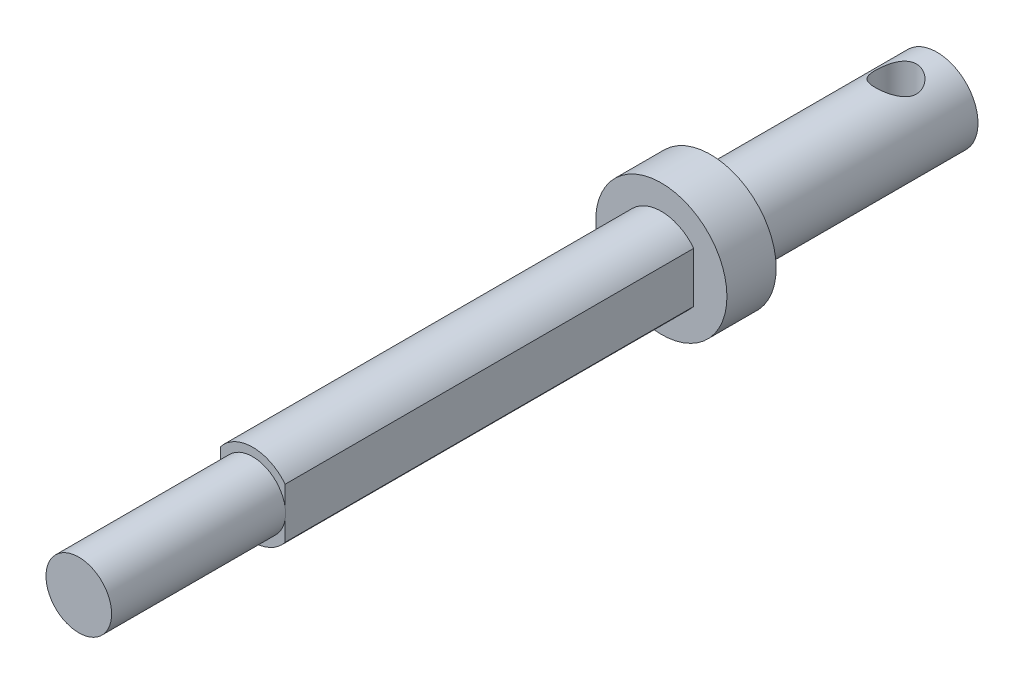
ISO-10303-21;
HEADER;
FILE_DESCRIPTION(('STEP AP214'),'2;1');
FILE_NAME('part.step','',(''),(''),'','','');
FILE_SCHEMA(('AUTOMOTIVE_DESIGN { 1 0 10303 214 1 1 1 1 }'));
ENDSEC;
DATA;
#1=APPLICATION_CONTEXT('core data for automotive mechanical design processes');
#2=APPLICATION_PROTOCOL_DEFINITION('international standard','automotive_design',2000,#1);
#3=PRODUCT_CONTEXT('',#1,'mechanical');
#4=PRODUCT('Part','Part','',(#3));
#5=PRODUCT_RELATED_PRODUCT_CATEGORY('part','',(#4));
#6=PRODUCT_DEFINITION_FORMATION('','',#4);
#7=PRODUCT_DEFINITION_CONTEXT('part definition',#1,'design');
#8=PRODUCT_DEFINITION('design','',#6,#7);
#9=PRODUCT_DEFINITION_SHAPE('','',#8);
#10=(LENGTH_UNIT() NAMED_UNIT(*) SI_UNIT(.MILLI.,.METRE.));
#11=(NAMED_UNIT(*) PLANE_ANGLE_UNIT() SI_UNIT($,.RADIAN.));
#12=(NAMED_UNIT(*) SI_UNIT($,.STERADIAN.) SOLID_ANGLE_UNIT());
#13=UNCERTAINTY_MEASURE_WITH_UNIT(LENGTH_MEASURE(1.E-05),#10,'distance_accuracy_value','');
#14=(GEOMETRIC_REPRESENTATION_CONTEXT(3) GLOBAL_UNCERTAINTY_ASSIGNED_CONTEXT((#13)) GLOBAL_UNIT_ASSIGNED_CONTEXT((#10,
#11,#12)) REPRESENTATION_CONTEXT('',''));
#15=CARTESIAN_POINT('',(0.,0.,0.));
#16=DIRECTION('',(0.,0.,1.));
#17=DIRECTION('',(1.,0.,0.));
#18=AXIS2_PLACEMENT_3D('',#15,#16,#17);
#19=CARTESIAN_POINT('',(0.,0.,41.7));
#20=DIRECTION('',(0.,0.,1.));
#21=DIRECTION('',(1.,0.,0.));
#22=AXIS2_PLACEMENT_3D('',#19,#20,#21);
#23=PLANE('',#22);
#24=CARTESIAN_POINT('',(0.,0.,41.7));
#25=DIRECTION('',(0.,0.,1.));
#26=DIRECTION('',(1.,0.,0.));
#27=AXIS2_PLACEMENT_3D('',#24,#25,#26);
#28=CIRCLE('',#27,2.);
#29=CARTESIAN_POINT('',(1.975,0.315238005322961,41.7));
#30=VERTEX_POINT('',#29);
#31=CARTESIAN_POINT('',(-1.975,0.315238005322961,41.7));
#32=VERTEX_POINT('',#31);
#33=EDGE_CURVE('E62',#30,#32,#28,.T.);
#34=ORIENTED_EDGE('',*,*,#33,.F.);
#35=DIRECTION('',(0.,-1.,0.));
#36=VECTOR('',#35,1.);
#37=CARTESIAN_POINT('',(1.975,0.,41.7));
#38=LINE('',#37,#36);
#39=CARTESIAN_POINT('',(1.975,1.53276710559693,41.7));
#40=VERTEX_POINT('',#39);
#41=EDGE_CURVE('E115',#40,#30,#38,.T.);
#42=ORIENTED_EDGE('',*,*,#41,.F.);
#43=CARTESIAN_POINT('',(0.,0.,41.7));
#44=DIRECTION('',(0.,0.,1.));
#45=DIRECTION('',(1.,0.,0.));
#46=AXIS2_PLACEMENT_3D('',#43,#44,#45);
#47=CIRCLE('',#46,2.5);
#48=CARTESIAN_POINT('',(-1.975,1.53276710559693,41.7));
#49=VERTEX_POINT('',#48);
#50=EDGE_CURVE('E145',#40,#49,#47,.T.);
#51=ORIENTED_EDGE('',*,*,#50,.T.);
#52=DIRECTION('',(0.,-1.,0.));
#53=VECTOR('',#52,1.);
#54=CARTESIAN_POINT('',(-1.975,0.,41.7));
#55=LINE('',#54,#53);
#56=EDGE_CURVE('E149',#49,#32,#55,.T.);
#57=ORIENTED_EDGE('',*,*,#56,.T.);
#58=EDGE_LOOP('',(#34,#42,#51,#57));
#59=FACE_BOUND('',#58,.T.);
#60=ADVANCED_FACE('F45',(#59),#23,.T.);
#61=CARTESIAN_POINT('',(0.,0.,13.8));
#62=DIRECTION('',(0.,0.,-1.));
#63=DIRECTION('',(-1.,0.,0.));
#64=AXIS2_PLACEMENT_3D('',#61,#62,#63);
#65=CYLINDRICAL_SURFACE('',#64,2.5);
#66=CARTESIAN_POINT('',(0.,-2.5,3.75));
#67=CARTESIAN_POINT('',(0.0657149536912331,-2.49999641755188,3.74999587210062));
#68=CARTESIAN_POINT('',(0.131508249622541,-2.49738113774397,3.74478740859791));
#69=CARTESIAN_POINT('',(0.261150294085531,-2.48717695046745,3.72418389957385));
#70=CARTESIAN_POINT('',(0.32499510839188,-2.47957859786229,3.70876950875294));
#71=CARTESIAN_POINT('',(0.448666931100718,-2.46020349254139,3.66850773922901));
#72=CARTESIAN_POINT('',(0.508508503673975,-2.448442989719,3.64369701968998));
#73=CARTESIAN_POINT('',(0.623090771008206,-2.42182220644723,3.58553672329382));
#74=CARTESIAN_POINT('',(0.677831867487563,-2.40696217041913,3.55218781968893));
#75=CARTESIAN_POINT('',(0.784384772202399,-2.37445322822571,3.47560343814338));
#76=CARTESIAN_POINT('',(0.83581901390264,-2.3566899890942,3.43189190095045));
#77=CARTESIAN_POINT('',(0.930974306083722,-2.3207496280843,3.33684815094121));
#78=CARTESIAN_POINT('',(0.974689478883458,-2.30257220261294,3.28551018528445));
#79=CARTESIAN_POINT('',(1.05656500056285,-2.26623688996684,3.17189581309577));
#80=CARTESIAN_POINT('',(1.09403166943955,-2.24818983712665,3.10907987706761));
#81=CARTESIAN_POINT('',(1.15771028361337,-2.21607473465401,2.97704083001723));
#82=CARTESIAN_POINT('',(1.18393026870792,-2.20200384508737,2.90782233909656));
#83=CARTESIAN_POINT('',(1.22266555273574,-2.18072333797261,2.7691686182226));
#84=CARTESIAN_POINT('',(1.23590732135055,-2.17315339479642,2.69999443491576));
#85=CARTESIAN_POINT('',(1.25053374163606,-2.1647736243566,2.56002645277565));
#86=CARTESIAN_POINT('',(1.25193011046634,-2.1639571167911,2.48923432391106));
#87=CARTESIAN_POINT('',(1.24335910896537,-2.16888662821561,2.35714246960579));
#88=CARTESIAN_POINT('',(1.23473069942103,-2.17385954577517,2.29571996097119));
#89=CARTESIAN_POINT('',(1.20867481132117,-2.18845285917313,2.1753476132837));
#90=CARTESIAN_POINT('',(1.19124452987206,-2.1980747353972,2.11639856836836));
#91=CARTESIAN_POINT('',(1.1477622254825,-2.22109345515926,2.00096358429293));
#92=CARTESIAN_POINT('',(1.12151883389499,-2.23457300829998,1.94456700151776));
#93=CARTESIAN_POINT('',(1.061302109585,-2.26379255351755,1.83670713426249));
#94=CARTESIAN_POINT('',(1.02732530476558,-2.27953355975238,1.78524608049989));
#95=CARTESIAN_POINT('',(0.947582568640986,-2.31391447379107,1.68184843407097));
#96=CARTESIAN_POINT('',(0.900868072961602,-2.33266887795933,1.6306789080298));
#97=CARTESIAN_POINT('',(0.799444473426717,-2.36934529125509,1.53658072676137));
#98=CARTESIAN_POINT('',(0.744731570717857,-2.38726689948501,1.49365600995765));
#99=CARTESIAN_POINT('',(0.625645632289811,-2.42127484103705,1.41539292371284));
#100=CARTESIAN_POINT('',(0.560941989499261,-2.43723730202509,1.38049940944282));
#101=CARTESIAN_POINT('',(0.425582769360996,-2.46447351401553,1.32237871369624));
#102=CARTESIAN_POINT('',(0.354931970331596,-2.47575098679441,1.29914226873104));
#103=CARTESIAN_POINT('',(0.215958114575877,-2.49155417176795,1.26690574535416));
#104=CARTESIAN_POINT('',(0.147926913185405,-2.4965617287664,1.25688595531653));
#105=CARTESIAN_POINT('',(0.0109744999366921,-2.50091266823877,1.24816908608189));
#106=CARTESIAN_POINT('',(-0.0579462748373765,-2.5002587340164,1.24946664295065));
#107=CARTESIAN_POINT('',(-0.189041214982492,-2.49363990316801,1.26275836052344));
#108=CARTESIAN_POINT('',(-0.251324260062442,-2.48809057110237,1.27391566591254));
#109=CARTESIAN_POINT('',(-0.373008615377395,-2.47277714143524,1.30529758986886));
#110=CARTESIAN_POINT('',(-0.432409607113746,-2.46301257917916,1.3255232080667));
#111=CARTESIAN_POINT('',(-0.548610760562082,-2.43980314267087,1.37499808304146));
#112=CARTESIAN_POINT('',(-0.605287996257692,-2.42626102212424,1.40448881264602));
#113=CARTESIAN_POINT('',(-0.713076702123651,-2.39679967896386,1.47138441955755));
#114=CARTESIAN_POINT('',(-0.764185787219103,-2.38087944457231,1.50879266824179));
#115=CARTESIAN_POINT('',(-0.864709611613316,-2.3463527667183,1.59470053166609));
#116=CARTESIAN_POINT('',(-0.913465097280799,-2.32763606060552,1.64392858556696));
#117=CARTESIAN_POINT('',(-1.00232040139155,-2.29077989504843,1.74990643908663));
#118=CARTESIAN_POINT('',(-1.04241423211355,-2.27264084226908,1.80666139852047));
#119=CARTESIAN_POINT('',(-1.11463489312212,-2.23813990282585,1.92955456775039));
#120=CARTESIAN_POINT('',(-1.1462818698483,-2.2219066207934,1.99601408276074));
#121=CARTESIAN_POINT('',(-1.19760353251725,-2.19467590460158,2.13438758461565));
#122=CARTESIAN_POINT('',(-1.21729364485946,-2.18367172800773,2.20629440812648));
#123=CARTESIAN_POINT('',(-1.2423271093121,-2.16951876260833,2.34613777857681));
#124=CARTESIAN_POINT('',(-1.24886624550108,-2.16571729325614,2.41379281678629));
#125=CARTESIAN_POINT('',(-1.25086144297598,-2.16456693307719,2.54930883396341));
#126=CARTESIAN_POINT('',(-1.2463223082805,-2.16721524534441,2.61716971092429));
#127=CARTESIAN_POINT('',(-1.22740765699033,-2.17797327562531,2.74435437691502));
#128=CARTESIAN_POINT('',(-1.2140103929285,-2.18553868102992,2.8038755876805));
#129=CARTESIAN_POINT('',(-1.17896919778081,-2.20463770234897,2.91976014928088));
#130=CARTESIAN_POINT('',(-1.15732261394976,-2.21617259462094,2.97612247761496));
#131=CARTESIAN_POINT('',(-1.10476968162585,-2.2428566295566,3.08828106373326));
#132=CARTESIAN_POINT('',(-1.07333892227057,-2.25819652995238,3.14378487728713));
#133=CARTESIAN_POINT('',(-1.00268871454579,-2.29044164543238,3.24909317022573));
#134=CARTESIAN_POINT('',(-0.963465214048311,-2.30734767243153,3.29889466314811));
#135=CARTESIAN_POINT('',(-0.872754158330802,-2.34327903949141,3.39767747794702));
#136=CARTESIAN_POINT('',(-0.820355528762714,-2.36231229139336,3.4458238779524));
#137=CARTESIAN_POINT('',(-0.70769350777535,-2.3984719031886,3.53282872927954));
#138=CARTESIAN_POINT('',(-0.647425904070981,-2.4155972326005,3.57168217428286));
#139=CARTESIAN_POINT('',(-0.519914496024933,-2.44622511981379,3.63904545345276));
#140=CARTESIAN_POINT('',(-0.452624379918267,-2.45970120703636,3.66748021176429));
#141=CARTESIAN_POINT('',(-0.313427626617739,-2.48126676704332,3.71226020989869));
#142=CARTESIAN_POINT('',(-0.241534749528957,-2.48937154216165,3.72863980853697));
#143=CARTESIAN_POINT('',(-0.140752433104229,-2.49619327387079,3.74237176384481));
#144=CARTESIAN_POINT('',(-0.112702349299373,-2.49761706674002,3.74522830107952));
#145=CARTESIAN_POINT('',(-0.0564396647589467,-2.49952121222331,3.74904333189601));
#146=CARTESIAN_POINT('',(-0.0282270595592265,-2.50000153879704,3.750001773089));
#147=CARTESIAN_POINT('',(0.,-2.5,3.75));
#148=B_SPLINE_CURVE_WITH_KNOTS('',3,(#66,#67,#68,#69,#70,#71,#72,#73,#74,#75,#76,#77,#78,#79,
#80,#81,#82,#83,#84,#85,#86,#87,#88,#89,#90,#91,#92,#93,#94,#95,#96,#97,#98,#99,#100,#101,#102,
#103,#104,#105,#106,#107,#108,#109,#110,#111,#112,#113,#114,#115,#116,#117,#118,#119,#120,#121,
#122,#123,#124,#125,#126,#127,#128,#129,#130,#131,#132,#133,#134,#135,#136,#137,#138,#139,#140,
#141,#142,#143,#144,#145,#146,#147),.UNSPECIFIED.,.T.,.F.,(4,2,2,2,2,2,2,2,2,2,2,2,2,2,2,2,2,2,
2,2,2,2,2,2,2,2,2,2,2,2,2,2,2,2,2,2,2,2,2,2,4),(0.,0.197030321775366,0.394435187136497,
0.591077694365373,0.78770470072696,0.996227198397611,1.20490779706754,1.42977158038441,
1.65447434872851,1.86572515175287,2.07676696661276,2.26257140511651,2.44843504907098,
2.63862800210609,2.82890651575277,3.04331176667348,3.25781918248358,3.48228777768051,
3.70657771140349,3.91229113089182,4.11790705639345,4.30758633132652,4.49728652038664,
4.69241070034873,4.88761813435424,5.10199513305523,5.3165198576929,5.54143352699593,
5.76605639925972,5.96911634372967,6.17208824825007,6.35572412805228,6.53941910979598,
6.73545570969518,6.93159451423697,7.15156553440623,7.37165479220716,7.59330017078656,
7.81431135781163,7.89894100172122,7.98357298143558),.UNSPECIFIED.);
#149=CARTESIAN_POINT('',(0.,-2.5,3.75));
#150=VERTEX_POINT('',#149);
#151=EDGE_CURVE('E50',#150,#150,#148,.T.);
#152=ORIENTED_EDGE('',*,*,#151,.T.);
#153=EDGE_LOOP('',(#152));
#154=FACE_BOUND('',#153,.T.);
#155=CARTESIAN_POINT('',(0.,2.5,3.75));
#156=CARTESIAN_POINT('',(-0.065714953691233,2.49999641755189,3.74999587210062));
#157=CARTESIAN_POINT('',(-0.13150824962254,2.49738113774397,3.74478740859791));
#158=CARTESIAN_POINT('',(-0.261150294085531,2.48717695046745,3.72418389957385));
#159=CARTESIAN_POINT('',(-0.324995108391879,2.47957859786229,3.70876950875294));
#160=CARTESIAN_POINT('',(-0.448666931100718,2.46020349254139,3.66850773922901));
#161=CARTESIAN_POINT('',(-0.508508503673975,2.448442989719,3.64369701968998));
#162=CARTESIAN_POINT('',(-0.623090771008206,2.42182220644723,3.58553672329382));
#163=CARTESIAN_POINT('',(-0.677831867487562,2.40696217041912,3.55218781968893));
#164=CARTESIAN_POINT('',(-0.784384772202399,2.37445322822571,3.47560343814338));
#165=CARTESIAN_POINT('',(-0.83581901390264,2.3566899890942,3.43189190095045));
#166=CARTESIAN_POINT('',(-0.930974306083721,2.3207496280843,3.33684815094121));
#167=CARTESIAN_POINT('',(-0.974689478883458,2.30257220261294,3.28551018528445));
#168=CARTESIAN_POINT('',(-1.05656500056285,2.26623688996684,3.17189581309577));
#169=CARTESIAN_POINT('',(-1.09403166943955,2.24818983712665,3.10907987706761));
#170=CARTESIAN_POINT('',(-1.15771028361337,2.21607473465401,2.97704083001723));
#171=CARTESIAN_POINT('',(-1.18393026870792,2.20200384508737,2.90782233909656));
#172=CARTESIAN_POINT('',(-1.22266555273574,2.18072333797261,2.7691686182226));
#173=CARTESIAN_POINT('',(-1.23590732135055,2.17315339479642,2.69999443491576));
#174=CARTESIAN_POINT('',(-1.25053374163606,2.1647736243566,2.56002645277565));
#175=CARTESIAN_POINT('',(-1.25193011046634,2.1639571167911,2.48923432391106));
#176=CARTESIAN_POINT('',(-1.24335910896537,2.16888662821561,2.35714246960579));
#177=CARTESIAN_POINT('',(-1.23473069942103,2.17385954577517,2.29571996097119));
#178=CARTESIAN_POINT('',(-1.20867481132117,2.18845285917313,2.1753476132837));
#179=CARTESIAN_POINT('',(-1.19124452987206,2.1980747353972,2.11639856836836));
#180=CARTESIAN_POINT('',(-1.1477622254825,2.22109345515926,2.00096358429293));
#181=CARTESIAN_POINT('',(-1.12151883389499,2.23457300829998,1.94456700151776));
#182=CARTESIAN_POINT('',(-1.061302109585,2.26379255351755,1.83670713426249));
#183=CARTESIAN_POINT('',(-1.02732530476558,2.27953355975238,1.78524608049989));
#184=CARTESIAN_POINT('',(-0.947582568640986,2.31391447379107,1.68184843407097));
#185=CARTESIAN_POINT('',(-0.900868072961603,2.33266887795933,1.6306789080298));
#186=CARTESIAN_POINT('',(-0.799444473426718,2.36934529125509,1.53658072676137));
#187=CARTESIAN_POINT('',(-0.744731570717858,2.38726689948501,1.49365600995765));
#188=CARTESIAN_POINT('',(-0.625645632289811,2.42127484103705,1.41539292371284));
#189=CARTESIAN_POINT('',(-0.560941989499262,2.43723730202509,1.38049940944283));
#190=CARTESIAN_POINT('',(-0.425582769360997,2.46447351401553,1.32237871369624));
#191=CARTESIAN_POINT('',(-0.354931970331597,2.47575098679441,1.29914226873104));
#192=CARTESIAN_POINT('',(-0.215958114575878,2.49155417176795,1.26690574535416));
#193=CARTESIAN_POINT('',(-0.147926913185406,2.4965617287664,1.25688595531653));
#194=CARTESIAN_POINT('',(-0.0109744999366928,2.50091266823877,1.24816908608189));
#195=CARTESIAN_POINT('',(0.0579462748373761,2.5002587340164,1.24946664295065));
#196=CARTESIAN_POINT('',(0.189041214982492,2.49363990316801,1.26275836052344));
#197=CARTESIAN_POINT('',(0.251324260062443,2.48809057110237,1.27391566591254));
#198=CARTESIAN_POINT('',(0.373008615377396,2.47277714143524,1.30529758986886));
#199=CARTESIAN_POINT('',(0.432409607113746,2.46301257917916,1.3255232080667));
#200=CARTESIAN_POINT('',(0.548610760562081,2.43980314267087,1.37499808304146));
#201=CARTESIAN_POINT('',(0.605287996257691,2.42626102212424,1.40448881264602));
#202=CARTESIAN_POINT('',(0.713076702123651,2.39679967896386,1.47138441955755));
#203=CARTESIAN_POINT('',(0.764185787219102,2.38087944457231,1.50879266824179));
#204=CARTESIAN_POINT('',(0.864709611613316,2.3463527667183,1.59470053166609));
#205=CARTESIAN_POINT('',(0.913465097280798,2.32763606060552,1.64392858556696));
#206=CARTESIAN_POINT('',(1.00232040139155,2.29077989504843,1.74990643908663));
#207=CARTESIAN_POINT('',(1.04241423211355,2.27264084226908,1.80666139852047));
#208=CARTESIAN_POINT('',(1.11463489312212,2.23813990282585,1.92955456775039));
#209=CARTESIAN_POINT('',(1.1462818698483,2.2219066207934,1.99601408276074));
#210=CARTESIAN_POINT('',(1.19760353251725,2.19467590460158,2.13438758461565));
#211=CARTESIAN_POINT('',(1.21729364485946,2.18367172800773,2.20629440812648));
#212=CARTESIAN_POINT('',(1.2423271093121,2.16951876260833,2.34613777857681));
#213=CARTESIAN_POINT('',(1.24886624550108,2.16571729325614,2.41379281678629));
#214=CARTESIAN_POINT('',(1.25086144297598,2.16456693307719,2.54930883396341));
#215=CARTESIAN_POINT('',(1.2463223082805,2.16721524534441,2.61716971092429));
#216=CARTESIAN_POINT('',(1.22740765699033,2.17797327562531,2.74435437691502));
#217=CARTESIAN_POINT('',(1.2140103929285,2.18553868102992,2.8038755876805));
#218=CARTESIAN_POINT('',(1.17896919778081,2.20463770234897,2.91976014928088));
#219=CARTESIAN_POINT('',(1.15732261394976,2.21617259462094,2.97612247761496));
#220=CARTESIAN_POINT('',(1.10476968162585,2.2428566295566,3.08828106373326));
#221=CARTESIAN_POINT('',(1.07333892227057,2.25819652995238,3.14378487728712));
#222=CARTESIAN_POINT('',(1.00268871454579,2.29044164543238,3.24909317022573));
#223=CARTESIAN_POINT('',(0.963465214048311,2.30734767243153,3.29889466314811));
#224=CARTESIAN_POINT('',(0.872754158330802,2.34327903949141,3.39767747794702));
#225=CARTESIAN_POINT('',(0.820355528762715,2.36231229139336,3.4458238779524));
#226=CARTESIAN_POINT('',(0.70769350777535,2.3984719031886,3.53282872927954));
#227=CARTESIAN_POINT('',(0.647425904070982,2.4155972326005,3.57168217428286));
#228=CARTESIAN_POINT('',(0.519914496024934,2.44622511981379,3.63904545345275));
#229=CARTESIAN_POINT('',(0.452624379918269,2.45970120703636,3.66748021176429));
#230=CARTESIAN_POINT('',(0.31342762661774,2.48126676704332,3.71226020989869));
#231=CARTESIAN_POINT('',(0.241534749528958,2.48937154216165,3.72863980853697));
#232=CARTESIAN_POINT('',(0.140752433104231,2.49619327387079,3.74237176384481));
#233=CARTESIAN_POINT('',(0.112702349299374,2.49761706674002,3.74522830107952));
#234=CARTESIAN_POINT('',(0.0564396647589479,2.49952121222331,3.74904333189601));
#235=CARTESIAN_POINT('',(0.0282270595592271,2.50000153879704,3.750001773089));
#236=CARTESIAN_POINT('',(0.,2.5,3.75));
#237=B_SPLINE_CURVE_WITH_KNOTS('',3,(#155,#156,#157,#158,#159,#160,#161,#162,#163,#164,#165,
#166,#167,#168,#169,#170,#171,#172,#173,#174,#175,#176,#177,#178,#179,#180,#181,#182,#183,#184,
#185,#186,#187,#188,#189,#190,#191,#192,#193,#194,#195,#196,#197,#198,#199,#200,#201,#202,#203,
#204,#205,#206,#207,#208,#209,#210,#211,#212,#213,#214,#215,#216,#217,#218,#219,#220,#221,#222,
#223,#224,#225,#226,#227,#228,#229,#230,#231,#232,#233,#234,#235,#236),.UNSPECIFIED.,.T.,.F.,(4,
2,2,2,2,2,2,2,2,2,2,2,2,2,2,2,2,2,2,2,2,2,2,2,2,2,2,2,2,2,2,2,2,2,2,2,2,2,2,2,4),(0.,
0.197030321775365,0.394435187136497,0.591077694365373,0.787704700726959,0.996227198397611,
1.20490779706754,1.42977158038441,1.65447434872851,1.86572515175287,2.07676696661276,
2.26257140511651,2.44843504907098,2.63862800210609,2.82890651575277,3.04331176667348,
3.25781918248358,3.48228777768051,3.70657771140349,3.91229113089182,4.11790705639345,
4.30758633132652,4.49728652038664,4.69241070034873,4.88761813435424,5.10199513305523,
5.3165198576929,5.54143352699592,5.76605639925972,5.96911634372967,6.17208824825006,
6.35572412805228,6.53941910979597,6.73545570969518,6.93159451423697,7.15156553440623,
7.37165479220716,7.59330017078656,7.81431135781163,7.89894100172122,7.98357298143558),.UNSPECIFIED.);
#238=CARTESIAN_POINT('',(0.,2.5,3.75));
#239=VERTEX_POINT('',#238);
#240=EDGE_CURVE('E192',#239,#239,#237,.T.);
#241=ORIENTED_EDGE('',*,*,#240,.T.);
#242=EDGE_LOOP('',(#241));
#243=FACE_BOUND('',#242,.T.);
#244=CARTESIAN_POINT('',(0.,0.,13.8));
#245=DIRECTION('',(0.,0.,1.));
#246=DIRECTION('',(1.,0.,0.));
#247=AXIS2_PLACEMENT_3D('',#244,#245,#246);
#248=CIRCLE('',#247,2.5);
#249=CARTESIAN_POINT('',(2.5,0.,13.8));
#250=VERTEX_POINT('',#249);
#251=EDGE_CURVE('E60',#250,#250,#248,.T.);
#252=ORIENTED_EDGE('',*,*,#251,.F.);
#253=EDGE_LOOP('',(#252));
#254=FACE_BOUND('',#253,.T.);
#255=CARTESIAN_POINT('',(0.,0.,0.));
#256=DIRECTION('',(0.,0.,1.));
#257=DIRECTION('',(1.,0.,0.));
#258=AXIS2_PLACEMENT_3D('',#255,#256,#257);
#259=CIRCLE('',#258,2.5);
#260=CARTESIAN_POINT('',(2.5,0.,0.));
#261=VERTEX_POINT('',#260);
#262=EDGE_CURVE('E183',#261,#261,#259,.T.);
#263=ORIENTED_EDGE('',*,*,#262,.T.);
#264=EDGE_LOOP('',(#263));
#265=FACE_BOUND('',#264,.T.);
#266=ADVANCED_FACE('F47',(#154,#243,#254,#265),#65,.T.);
#267=CARTESIAN_POINT('',(0.,0.,0.));
#268=DIRECTION('',(0.,0.,1.));
#269=DIRECTION('',(1.,0.,0.));
#270=AXIS2_PLACEMENT_3D('',#267,#268,#269);
#271=PLANE('',#270);
#272=ORIENTED_EDGE('',*,*,#262,.F.);
#273=EDGE_LOOP('',(#272));
#274=FACE_BOUND('',#273,.T.);
#275=ADVANCED_FACE('F239',(#274),#271,.F.);
#276=CARTESIAN_POINT('',(0.,0.,16.8));
#277=DIRECTION('',(0.,0.,-1.));
#278=DIRECTION('',(-1.,0.,0.));
#279=AXIS2_PLACEMENT_3D('',#276,#277,#278);
#280=CYLINDRICAL_SURFACE('',#279,4.);
#281=CARTESIAN_POINT('',(0.,0.,16.8));
#282=DIRECTION('',(0.,0.,1.));
#283=DIRECTION('',(1.,0.,0.));
#284=AXIS2_PLACEMENT_3D('',#281,#282,#283);
#285=CIRCLE('',#284,4.);
#286=CARTESIAN_POINT('',(4.,0.,16.8));
#287=VERTEX_POINT('',#286);
#288=EDGE_CURVE('E179',#287,#287,#285,.T.);
#289=ORIENTED_EDGE('',*,*,#288,.F.);
#290=EDGE_LOOP('',(#289));
#291=FACE_BOUND('',#290,.T.);
#292=CARTESIAN_POINT('',(0.,0.,13.8));
#293=DIRECTION('',(0.,0.,1.));
#294=DIRECTION('',(1.,0.,0.));
#295=AXIS2_PLACEMENT_3D('',#292,#293,#294);
#296=CIRCLE('',#295,4.);
#297=CARTESIAN_POINT('',(4.,0.,13.8));
#298=VERTEX_POINT('',#297);
#299=EDGE_CURVE('E178',#298,#298,#296,.T.);
#300=ORIENTED_EDGE('',*,*,#299,.T.);
#301=EDGE_LOOP('',(#300));
#302=FACE_BOUND('',#301,.T.);
#303=ADVANCED_FACE('F233',(#291,#302),#280,.T.);
#304=CARTESIAN_POINT('',(0.,0.,16.8));
#305=DIRECTION('',(0.,0.,1.));
#306=DIRECTION('',(1.,0.,0.));
#307=AXIS2_PLACEMENT_3D('',#304,#305,#306);
#308=PLANE('',#307);
#309=CARTESIAN_POINT('',(0.,0.,16.8));
#310=DIRECTION('',(0.,0.,1.));
#311=DIRECTION('',(1.,0.,0.));
#312=AXIS2_PLACEMENT_3D('',#309,#310,#311);
#313=CIRCLE('',#312,2.5);
#314=CARTESIAN_POINT('',(-1.975,-1.53276710559693,16.8));
#315=VERTEX_POINT('',#314);
#316=CARTESIAN_POINT('',(1.975,-1.53276710559693,16.8));
#317=VERTEX_POINT('',#316);
#318=EDGE_CURVE('E153',#315,#317,#313,.T.);
#319=ORIENTED_EDGE('',*,*,#318,.F.);
#320=DIRECTION('',(0.,-1.,0.));
#321=VECTOR('',#320,1.);
#322=CARTESIAN_POINT('',(-1.975,0.,16.8));
#323=LINE('',#322,#321);
#324=CARTESIAN_POINT('',(-1.975,1.53276710559693,16.8));
#325=VERTEX_POINT('',#324);
#326=EDGE_CURVE('E142',#325,#315,#323,.T.);
#327=ORIENTED_EDGE('',*,*,#326,.F.);
#328=CARTESIAN_POINT('',(0.,0.,16.8));
#329=DIRECTION('',(0.,0.,1.));
#330=DIRECTION('',(1.,0.,0.));
#331=AXIS2_PLACEMENT_3D('',#328,#329,#330);
#332=CIRCLE('',#331,2.5);
#333=CARTESIAN_POINT('',(1.975,1.53276710559693,16.8));
#334=VERTEX_POINT('',#333);
#335=EDGE_CURVE('E160',#334,#325,#332,.T.);
#336=ORIENTED_EDGE('',*,*,#335,.F.);
#337=DIRECTION('',(0.,-1.,0.));
#338=VECTOR('',#337,1.);
#339=CARTESIAN_POINT('',(1.975,0.,16.8));
#340=LINE('',#339,#338);
#341=EDGE_CURVE('E156',#334,#317,#340,.T.);
#342=ORIENTED_EDGE('',*,*,#341,.T.);
#343=EDGE_LOOP('',(#319,#327,#336,#342));
#344=FACE_BOUND('',#343,.T.);
#345=ORIENTED_EDGE('',*,*,#288,.T.);
#346=EDGE_LOOP('',(#345));
#347=FACE_BOUND('',#346,.T.);
#348=ADVANCED_FACE('F230',(#344,#347),#308,.T.);
#349=CARTESIAN_POINT('',(0.,0.,13.8));
#350=DIRECTION('',(0.,0.,1.));
#351=DIRECTION('',(1.,0.,0.));
#352=AXIS2_PLACEMENT_3D('',#349,#350,#351);
#353=PLANE('',#352);
#354=ORIENTED_EDGE('',*,*,#251,.T.);
#355=EDGE_LOOP('',(#354));
#356=FACE_BOUND('',#355,.T.);
#357=ORIENTED_EDGE('',*,*,#299,.F.);
#358=EDGE_LOOP('',(#357));
#359=FACE_BOUND('',#358,.T.);
#360=ADVANCED_FACE('F228',(#356,#359),#353,.F.);
#361=CARTESIAN_POINT('',(0.,0.,41.7));
#362=DIRECTION('',(0.,0.,-1.));
#363=DIRECTION('',(-1.,0.,0.));
#364=AXIS2_PLACEMENT_3D('',#361,#362,#363);
#365=CYLINDRICAL_SURFACE('',#364,2.5);
#366=ORIENTED_EDGE('',*,*,#318,.T.);
#367=DIRECTION('',(0.,0.,-1.));
#368=VECTOR('',#367,1.);
#369=CARTESIAN_POINT('',(1.975,-1.53276710559693,41.7));
#370=LINE('',#369,#368);
#371=CARTESIAN_POINT('',(1.975,-1.53276710559693,41.7));
#372=VERTEX_POINT('',#371);
#373=EDGE_CURVE('E175',#372,#317,#370,.T.);
#374=ORIENTED_EDGE('',*,*,#373,.F.);
#375=CARTESIAN_POINT('',(0.,0.,41.7));
#376=DIRECTION('',(0.,0.,1.));
#377=DIRECTION('',(1.,0.,0.));
#378=AXIS2_PLACEMENT_3D('',#375,#376,#377);
#379=CIRCLE('',#378,2.5);
#380=CARTESIAN_POINT('',(-1.975,-1.53276710559693,41.7));
#381=VERTEX_POINT('',#380);
#382=EDGE_CURVE('E123',#381,#372,#379,.T.);
#383=ORIENTED_EDGE('',*,*,#382,.F.);
#384=DIRECTION('',(0.,0.,-1.));
#385=VECTOR('',#384,1.);
#386=CARTESIAN_POINT('',(-1.975,-1.53276710559693,41.7));
#387=LINE('',#386,#385);
#388=EDGE_CURVE('E152',#381,#315,#387,.T.);
#389=ORIENTED_EDGE('',*,*,#388,.T.);
#390=EDGE_LOOP('',(#366,#374,#383,#389));
#391=FACE_BOUND('',#390,.T.);
#392=ADVANCED_FACE('F225',(#391),#365,.T.);
#393=CARTESIAN_POINT('',(1.975,0.,41.7));
#394=DIRECTION('',(1.,0.,0.));
#395=DIRECTION('',(0.,0.,-1.));
#396=AXIS2_PLACEMENT_3D('',#393,#394,#395);
#397=PLANE('',#396);
#398=ORIENTED_EDGE('',*,*,#341,.F.);
#399=DIRECTION('',(0.,0.,-1.));
#400=VECTOR('',#399,1.);
#401=CARTESIAN_POINT('',(1.975,1.53276710559693,41.7));
#402=LINE('',#401,#400);
#403=EDGE_CURVE('E172',#40,#334,#402,.T.);
#404=ORIENTED_EDGE('',*,*,#403,.F.);
#405=ORIENTED_EDGE('',*,*,#41,.T.);
#406=CARTESIAN_POINT('',(1.975,-0.315238005322961,41.7));
#407=VERTEX_POINT('',#406);
#408=EDGE_CURVE('E108',#30,#407,#38,.T.);
#409=ORIENTED_EDGE('',*,*,#408,.T.);
#410=EDGE_CURVE('E112',#407,#372,#38,.T.);
#411=ORIENTED_EDGE('',*,*,#410,.T.);
#412=ORIENTED_EDGE('',*,*,#373,.T.);
#413=EDGE_LOOP('',(#398,#404,#405,#409,#411,#412));
#414=FACE_BOUND('',#413,.T.);
#415=ADVANCED_FACE('F110',(#414),#397,.T.);
#416=CARTESIAN_POINT('',(0.,0.,41.7));
#417=DIRECTION('',(0.,0.,-1.));
#418=DIRECTION('',(-1.,0.,0.));
#419=AXIS2_PLACEMENT_3D('',#416,#417,#418);
#420=CYLINDRICAL_SURFACE('',#419,2.5);
#421=ORIENTED_EDGE('',*,*,#335,.T.);
#422=DIRECTION('',(0.,0.,-1.));
#423=VECTOR('',#422,1.);
#424=CARTESIAN_POINT('',(-1.975,1.53276710559693,41.7));
#425=LINE('',#424,#423);
#426=EDGE_CURVE('E168',#49,#325,#425,.T.);
#427=ORIENTED_EDGE('',*,*,#426,.F.);
#428=ORIENTED_EDGE('',*,*,#50,.F.);
#429=ORIENTED_EDGE('',*,*,#403,.T.);
#430=EDGE_LOOP('',(#421,#427,#428,#429));
#431=FACE_BOUND('',#430,.T.);
#432=ADVANCED_FACE('F219',(#431),#420,.T.);
#433=CARTESIAN_POINT('',(-1.975,0.,41.7));
#434=DIRECTION('',(1.,0.,0.));
#435=DIRECTION('',(0.,0.,-1.));
#436=AXIS2_PLACEMENT_3D('',#433,#434,#435);
#437=PLANE('',#436);
#438=ORIENTED_EDGE('',*,*,#326,.T.);
#439=ORIENTED_EDGE('',*,*,#388,.F.);
#440=CARTESIAN_POINT('',(-1.975,-0.315238005322961,41.7));
#441=VERTEX_POINT('',#440);
#442=EDGE_CURVE('E148',#441,#381,#55,.T.);
#443=ORIENTED_EDGE('',*,*,#442,.F.);
#444=EDGE_CURVE('E75',#32,#441,#55,.T.);
#445=ORIENTED_EDGE('',*,*,#444,.F.);
#446=ORIENTED_EDGE('',*,*,#56,.F.);
#447=ORIENTED_EDGE('',*,*,#426,.T.);
#448=EDGE_LOOP('',(#438,#439,#443,#445,#446,#447));
#449=FACE_BOUND('',#448,.T.);
#450=ADVANCED_FACE('F216',(#449),#437,.F.);
#451=EDGE_CURVE('E11',#441,#407,#28,.T.);
#452=ORIENTED_EDGE('',*,*,#451,.F.);
#453=ORIENTED_EDGE('',*,*,#442,.T.);
#454=ORIENTED_EDGE('',*,*,#382,.T.);
#455=ORIENTED_EDGE('',*,*,#410,.F.);
#456=EDGE_LOOP('',(#452,#453,#454,#455));
#457=FACE_BOUND('',#456,.T.);
#458=ADVANCED_FACE('F121',(#457),#23,.T.);
#459=CARTESIAN_POINT('',(0.,0.,41.7));
#460=DIRECTION('',(0.,0.,1.));
#461=DIRECTION('',(1.,0.,0.));
#462=AXIS2_PLACEMENT_3D('',#459,#460,#461);
#463=PLANE('',#462);
#464=EDGE_CURVE('E63',#32,#441,#28,.T.);
#465=ORIENTED_EDGE('',*,*,#464,.F.);
#466=ORIENTED_EDGE('',*,*,#444,.T.);
#467=EDGE_LOOP('',(#465,#466));
#468=FACE_BOUND('',#467,.T.);
#469=ADVANCED_FACE('F210',(#468),#463,.F.);
#470=CARTESIAN_POINT('',(0.,0.,52.3));
#471=DIRECTION('',(0.,0.,-1.));
#472=DIRECTION('',(-1.,0.,0.));
#473=AXIS2_PLACEMENT_3D('',#470,#471,#472);
#474=CYLINDRICAL_SURFACE('',#473,2.);
#475=CARTESIAN_POINT('',(0.,0.,52.3));
#476=DIRECTION('',(0.,0.,1.));
#477=DIRECTION('',(1.,0.,0.));
#478=AXIS2_PLACEMENT_3D('',#475,#476,#477);
#479=CIRCLE('',#478,2.);
#480=CARTESIAN_POINT('',(2.,0.,52.3));
#481=VERTEX_POINT('',#480);
#482=EDGE_CURVE('E138',#481,#481,#479,.T.);
#483=ORIENTED_EDGE('',*,*,#482,.F.);
#484=EDGE_LOOP('',(#483));
#485=FACE_BOUND('',#484,.T.);
#486=ORIENTED_EDGE('',*,*,#33,.T.);
#487=ORIENTED_EDGE('',*,*,#464,.T.);
#488=ORIENTED_EDGE('',*,*,#451,.T.);
#489=EDGE_CURVE('E126',#407,#30,#28,.T.);
#490=ORIENTED_EDGE('',*,*,#489,.T.);
#491=EDGE_LOOP('',(#486,#487,#488,#490));
#492=FACE_BOUND('',#491,.T.);
#493=ADVANCED_FACE('F132',(#485,#492),#474,.T.);
#494=CARTESIAN_POINT('',(0.,0.,52.3));
#495=DIRECTION('',(0.,0.,1.));
#496=DIRECTION('',(1.,0.,0.));
#497=AXIS2_PLACEMENT_3D('',#494,#495,#496);
#498=PLANE('',#497);
#499=ORIENTED_EDGE('',*,*,#482,.T.);
#500=EDGE_LOOP('',(#499));
#501=FACE_BOUND('',#500,.T.);
#502=ADVANCED_FACE('F203',(#501),#498,.T.);
#503=ORIENTED_EDGE('',*,*,#408,.F.);
#504=ORIENTED_EDGE('',*,*,#489,.F.);
#505=EDGE_LOOP('',(#503,#504));
#506=FACE_BOUND('',#505,.T.);
#507=ADVANCED_FACE('F127',(#506),#463,.F.);
#508=CARTESIAN_POINT('',(0.,-4.,2.5));
#509=DIRECTION('',(0.,1.,0.));
#510=DIRECTION('',(0.,0.,1.));
#511=AXIS2_PLACEMENT_3D('',#508,#509,#510);
#512=CYLINDRICAL_SURFACE('',#511,1.25);
#513=ORIENTED_EDGE('',*,*,#240,.F.);
#514=EDGE_LOOP('',(#513));
#515=FACE_BOUND('',#514,.T.);
#516=ORIENTED_EDGE('',*,*,#151,.F.);
#517=EDGE_LOOP('',(#516));
#518=FACE_BOUND('',#517,.T.);
#519=ADVANCED_FACE('F198',(#515,#518),#512,.F.);
#520=CLOSED_SHELL('',(#60,#266,#275,#303,#348,#360,#392,#415,#432,#450,#458,#469,#493,#502,#507,#519));
#521=MANIFOLD_SOLID_BREP('B2',#520);
#522=ADVANCED_BREP_SHAPE_REPRESENTATION('',(#18,#521),#14);
#523=SHAPE_DEFINITION_REPRESENTATION(#9,#522);
ENDSEC;
END-ISO-10303-21;
